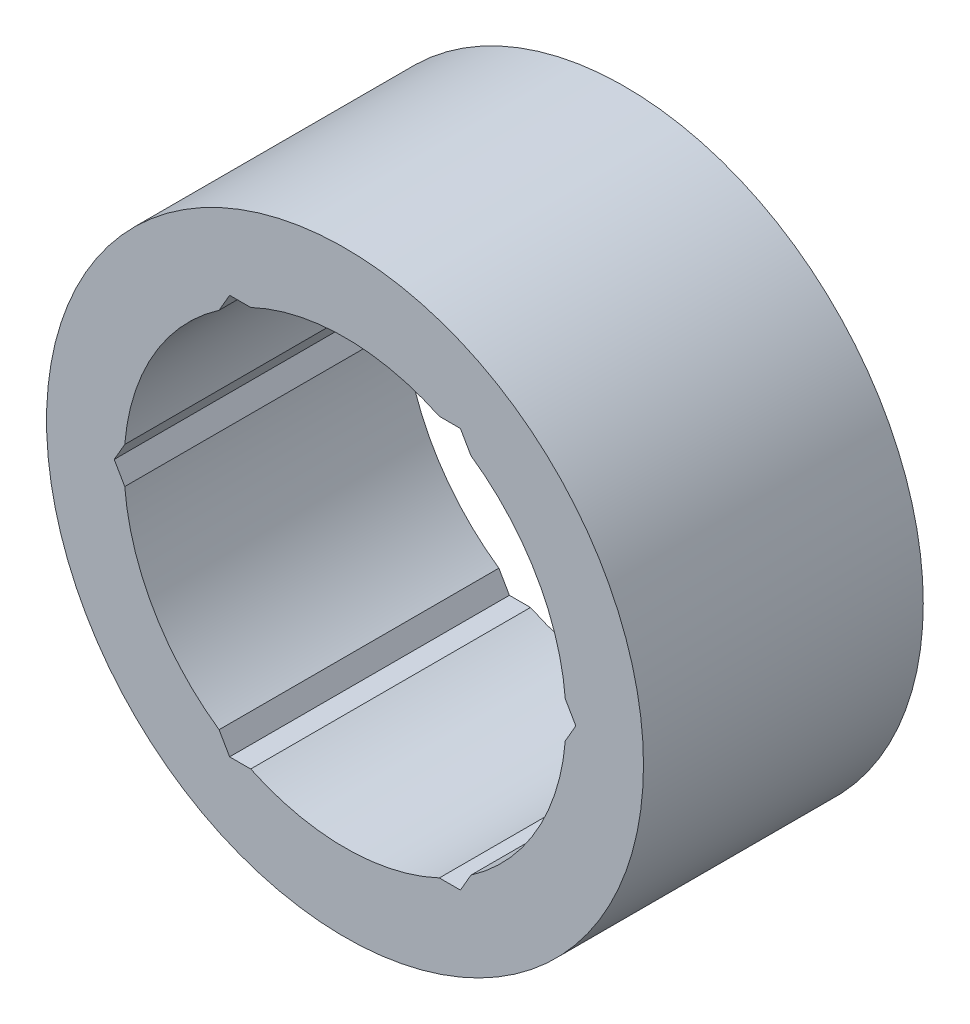
ISO-10303-21;
HEADER;
FILE_DESCRIPTION(('STEP AP214'),'2;1');
FILE_NAME('part.step','',(''),(''),'','','');
FILE_SCHEMA(('AUTOMOTIVE_DESIGN { 1 0 10303 214 1 1 1 1 }'));
ENDSEC;
DATA;
#1=APPLICATION_CONTEXT('core data for automotive mechanical design processes');
#2=APPLICATION_PROTOCOL_DEFINITION('international standard','automotive_design',2000,#1);
#3=PRODUCT_CONTEXT('',#1,'mechanical');
#4=PRODUCT('Part','Part','',(#3));
#5=PRODUCT_RELATED_PRODUCT_CATEGORY('part','',(#4));
#6=PRODUCT_DEFINITION_FORMATION('','',#4);
#7=PRODUCT_DEFINITION_CONTEXT('part definition',#1,'design');
#8=PRODUCT_DEFINITION('design','',#6,#7);
#9=PRODUCT_DEFINITION_SHAPE('','',#8);
#10=(LENGTH_UNIT() NAMED_UNIT(*) SI_UNIT(.MILLI.,.METRE.));
#11=(NAMED_UNIT(*) PLANE_ANGLE_UNIT() SI_UNIT($,.RADIAN.));
#12=(NAMED_UNIT(*) SI_UNIT($,.STERADIAN.) SOLID_ANGLE_UNIT());
#13=UNCERTAINTY_MEASURE_WITH_UNIT(LENGTH_MEASURE(1.E-05),#10,'distance_accuracy_value','');
#14=(GEOMETRIC_REPRESENTATION_CONTEXT(3) GLOBAL_UNCERTAINTY_ASSIGNED_CONTEXT((#13)) GLOBAL_UNIT_ASSIGNED_CONTEXT((#10,
#11,#12)) REPRESENTATION_CONTEXT('',''));
#15=CARTESIAN_POINT('',(0.,0.,0.));
#16=DIRECTION('',(0.,0.,1.));
#17=DIRECTION('',(1.,0.,0.));
#18=AXIS2_PLACEMENT_3D('',#15,#16,#17);
#19=CARTESIAN_POINT('',(0.,0.,5.));
#20=DIRECTION('',(0.,0.,-1.));
#21=DIRECTION('',(-1.,0.,0.));
#22=AXIS2_PLACEMENT_3D('',#19,#20,#21);
#23=CYLINDRICAL_SURFACE('',#22,7.8994);
#24=DIRECTION('',(0.,0.,-1.));
#25=VECTOR('',#24,1.);
#26=CARTESIAN_POINT('',(7.87244448954837,0.652026164336591,5.));
#27=LINE('',#26,#25);
#28=CARTESIAN_POINT('',(7.87244448954837,0.65202616433659,5.));
#29=VERTEX_POINT('',#28);
#30=CARTESIAN_POINT('',(7.87244448954837,0.65202616433659,-5.));
#31=VERTEX_POINT('',#30);
#32=EDGE_CURVE('E12',#29,#31,#27,.T.);
#33=ORIENTED_EDGE('',*,*,#32,.F.);
#34=CARTESIAN_POINT('',(0.,0.,5.));
#35=DIRECTION('',(0.,0.,1.));
#36=DIRECTION('',(1.,0.,0.));
#37=AXIS2_PLACEMENT_3D('',#34,#35,#36);
#38=CIRCLE('',#37,7.8994);
#39=CARTESIAN_POINT('',(4.5008934670218,6.49172383566341,5.));
#40=VERTEX_POINT('',#39);
#41=EDGE_CURVE('E240',#29,#40,#38,.T.);
#42=ORIENTED_EDGE('',*,*,#41,.T.);
#43=DIRECTION('',(0.,0.,-1.));
#44=VECTOR('',#43,1.);
#45=CARTESIAN_POINT('',(4.5008934670218,6.49172383566341,5.));
#46=LINE('',#45,#44);
#47=CARTESIAN_POINT('',(4.5008934670218,6.49172383566341,-5.));
#48=VERTEX_POINT('',#47);
#49=EDGE_CURVE('E49',#48,#40,#46,.F.);
#50=ORIENTED_EDGE('',*,*,#49,.F.);
#51=CARTESIAN_POINT('',(0.,0.,-5.));
#52=DIRECTION('',(0.,0.,1.));
#53=DIRECTION('',(1.,0.,0.));
#54=AXIS2_PLACEMENT_3D('',#51,#52,#53);
#55=CIRCLE('',#54,7.8994);
#56=EDGE_CURVE('E192',#31,#48,#55,.T.);
#57=ORIENTED_EDGE('',*,*,#56,.F.);
#58=EDGE_LOOP('',(#33,#42,#50,#57));
#59=FACE_BOUND('',#58,.T.);
#60=ADVANCED_FACE('F41',(#59),#23,.F.);
#61=DIRECTION('',(0.,0.,-1.));
#62=VECTOR('',#61,1.);
#63=CARTESIAN_POINT('',(4.50089346702179,-6.49172383566342,5.));
#64=LINE('',#63,#62);
#65=CARTESIAN_POINT('',(4.5008934670218,-6.49172383566341,5.));
#66=VERTEX_POINT('',#65);
#67=CARTESIAN_POINT('',(4.5008934670218,-6.49172383566341,-5.));
#68=VERTEX_POINT('',#67);
#69=EDGE_CURVE('E270',#66,#68,#64,.T.);
#70=ORIENTED_EDGE('',*,*,#69,.F.);
#71=CARTESIAN_POINT('',(7.87244448954837,-0.652026164336583,5.));
#72=VERTEX_POINT('',#71);
#73=EDGE_CURVE('E245',#66,#72,#38,.T.);
#74=ORIENTED_EDGE('',*,*,#73,.T.);
#75=DIRECTION('',(0.,0.,-1.));
#76=VECTOR('',#75,1.);
#77=CARTESIAN_POINT('',(7.87244448954837,-0.652026164336583,5.));
#78=LINE('',#77,#76);
#79=CARTESIAN_POINT('',(7.87244448954837,-0.652026164336583,-5.));
#80=VERTEX_POINT('',#79);
#81=EDGE_CURVE('E268',#80,#72,#78,.F.);
#82=ORIENTED_EDGE('',*,*,#81,.F.);
#83=EDGE_CURVE('E228',#68,#80,#55,.T.);
#84=ORIENTED_EDGE('',*,*,#83,.F.);
#85=EDGE_LOOP('',(#70,#74,#82,#84));
#86=FACE_BOUND('',#85,.T.);
#87=ADVANCED_FACE('F352',(#86),#23,.F.);
#88=DIRECTION('',(0.,0.,-1.));
#89=VECTOR('',#88,1.);
#90=CARTESIAN_POINT('',(-3.37155102252657,-7.14375,5.));
#91=LINE('',#90,#89);
#92=CARTESIAN_POINT('',(-3.37155102252657,-7.14375,5.));
#93=VERTEX_POINT('',#92);
#94=CARTESIAN_POINT('',(-3.37155102252657,-7.14375,-5.));
#95=VERTEX_POINT('',#94);
#96=EDGE_CURVE('E266',#93,#95,#91,.T.);
#97=ORIENTED_EDGE('',*,*,#96,.F.);
#98=CARTESIAN_POINT('',(3.37155102252658,-7.14375,5.));
#99=VERTEX_POINT('',#98);
#100=EDGE_CURVE('E338',#93,#99,#38,.T.);
#101=ORIENTED_EDGE('',*,*,#100,.T.);
#102=DIRECTION('',(0.,0.,-1.));
#103=VECTOR('',#102,1.);
#104=CARTESIAN_POINT('',(3.37155102252658,-7.14375,5.));
#105=LINE('',#104,#103);
#106=CARTESIAN_POINT('',(3.37155102252658,-7.14375,-5.));
#107=VERTEX_POINT('',#106);
#108=EDGE_CURVE('E264',#107,#99,#105,.F.);
#109=ORIENTED_EDGE('',*,*,#108,.F.);
#110=EDGE_CURVE('E287',#95,#107,#55,.T.);
#111=ORIENTED_EDGE('',*,*,#110,.F.);
#112=EDGE_LOOP('',(#97,#101,#109,#111));
#113=FACE_BOUND('',#112,.T.);
#114=ADVANCED_FACE('F344',(#113),#23,.F.);
#115=DIRECTION('',(0.,0.,-1.));
#116=VECTOR('',#115,1.);
#117=CARTESIAN_POINT('',(-7.87244448954837,-0.65202616433658,5.));
#118=LINE('',#117,#116);
#119=CARTESIAN_POINT('',(-7.87244448954837,-0.652026164336582,5.));
#120=VERTEX_POINT('',#119);
#121=CARTESIAN_POINT('',(-7.87244448954837,-0.652026164336582,-5.));
#122=VERTEX_POINT('',#121);
#123=EDGE_CURVE('E262',#120,#122,#118,.T.);
#124=ORIENTED_EDGE('',*,*,#123,.F.);
#125=CARTESIAN_POINT('',(-4.50089346702179,-6.49172383566342,5.));
#126=VERTEX_POINT('',#125);
#127=EDGE_CURVE('E324',#120,#126,#38,.T.);
#128=ORIENTED_EDGE('',*,*,#127,.T.);
#129=DIRECTION('',(0.,0.,-1.));
#130=VECTOR('',#129,1.);
#131=CARTESIAN_POINT('',(-4.50089346702179,-6.49172383566342,5.));
#132=LINE('',#131,#130);
#133=CARTESIAN_POINT('',(-4.50089346702179,-6.49172383566342,-5.));
#134=VERTEX_POINT('',#133);
#135=EDGE_CURVE('E260',#134,#126,#132,.F.);
#136=ORIENTED_EDGE('',*,*,#135,.F.);
#137=EDGE_CURVE('E289',#122,#134,#55,.T.);
#138=ORIENTED_EDGE('',*,*,#137,.F.);
#139=EDGE_LOOP('',(#124,#128,#136,#138));
#140=FACE_BOUND('',#139,.T.);
#141=ADVANCED_FACE('F330',(#140),#23,.F.);
#142=DIRECTION('',(0.,0.,-1.));
#143=VECTOR('',#142,1.);
#144=CARTESIAN_POINT('',(-4.50089346702179,6.49172383566342,5.));
#145=LINE('',#144,#143);
#146=CARTESIAN_POINT('',(-4.50089346702179,6.49172383566342,5.));
#147=VERTEX_POINT('',#146);
#148=CARTESIAN_POINT('',(-4.50089346702179,6.49172383566342,-5.));
#149=VERTEX_POINT('',#148);
#150=EDGE_CURVE('E258',#147,#149,#145,.T.);
#151=ORIENTED_EDGE('',*,*,#150,.F.);
#152=CARTESIAN_POINT('',(-7.87244448954837,0.652026164336582,5.));
#153=VERTEX_POINT('',#152);
#154=EDGE_CURVE('E310',#147,#153,#38,.T.);
#155=ORIENTED_EDGE('',*,*,#154,.T.);
#156=DIRECTION('',(0.,0.,-1.));
#157=VECTOR('',#156,1.);
#158=CARTESIAN_POINT('',(-7.87244448954837,0.65202616433658,5.));
#159=LINE('',#158,#157);
#160=CARTESIAN_POINT('',(-7.87244448954837,0.652026164336582,-5.));
#161=VERTEX_POINT('',#160);
#162=EDGE_CURVE('E256',#161,#153,#159,.F.);
#163=ORIENTED_EDGE('',*,*,#162,.F.);
#164=EDGE_CURVE('E292',#149,#161,#55,.T.);
#165=ORIENTED_EDGE('',*,*,#164,.F.);
#166=EDGE_LOOP('',(#151,#155,#163,#165));
#167=FACE_BOUND('',#166,.T.);
#168=ADVANCED_FACE('F316',(#167),#23,.F.);
#169=CARTESIAN_POINT('',(0.,0.,5.));
#170=DIRECTION('',(0.,0.,1.));
#171=DIRECTION('',(1.,0.,0.));
#172=AXIS2_PLACEMENT_3D('',#169,#170,#171);
#173=PLANE('',#172);
#174=DIRECTION('',(-0.5,0.866025403784439,0.));
#175=VECTOR('',#174,1.);
#176=CARTESIAN_POINT('',(8.24889197104678,0.,5.));
#177=LINE('',#176,#175);
#178=CARTESIAN_POINT('',(8.24889197104678,0.,5.));
#179=VERTEX_POINT('',#178);
#180=EDGE_CURVE('E211',#179,#29,#177,.T.);
#181=ORIENTED_EDGE('',*,*,#180,.F.);
#182=DIRECTION('',(0.5,0.866025403784439,0.));
#183=VECTOR('',#182,1.);
#184=CARTESIAN_POINT('',(4.12444598552339,-7.14375,5.));
#185=LINE('',#184,#183);
#186=EDGE_CURVE('E196',#72,#179,#185,.T.);
#187=ORIENTED_EDGE('',*,*,#186,.F.);
#188=ORIENTED_EDGE('',*,*,#73,.F.);
#189=CARTESIAN_POINT('',(4.12444598552339,-7.14375,5.));
#190=VERTEX_POINT('',#189);
#191=EDGE_CURVE('E194',#190,#66,#185,.T.);
#192=ORIENTED_EDGE('',*,*,#191,.F.);
#193=DIRECTION('',(1.,0.,0.));
#194=VECTOR('',#193,1.);
#195=CARTESIAN_POINT('',(-4.12444598552339,-7.14375,5.));
#196=LINE('',#195,#194);
#197=EDGE_CURVE('E222',#99,#190,#196,.T.);
#198=ORIENTED_EDGE('',*,*,#197,.F.);
#199=ORIENTED_EDGE('',*,*,#100,.F.);
#200=CARTESIAN_POINT('',(-4.12444598552339,-7.14375,5.));
#201=VERTEX_POINT('',#200);
#202=EDGE_CURVE('E223',#201,#93,#196,.T.);
#203=ORIENTED_EDGE('',*,*,#202,.F.);
#204=DIRECTION('',(0.5,-0.866025403784439,0.));
#205=VECTOR('',#204,1.);
#206=CARTESIAN_POINT('',(-8.24889197104678,0.,5.));
#207=LINE('',#206,#205);
#208=EDGE_CURVE('E219',#126,#201,#207,.T.);
#209=ORIENTED_EDGE('',*,*,#208,.F.);
#210=ORIENTED_EDGE('',*,*,#127,.F.);
#211=CARTESIAN_POINT('',(-8.24889197104678,0.,5.));
#212=VERTEX_POINT('',#211);
#213=EDGE_CURVE('E220',#212,#120,#207,.T.);
#214=ORIENTED_EDGE('',*,*,#213,.F.);
#215=DIRECTION('',(-0.5,-0.866025403784439,0.));
#216=VECTOR('',#215,1.);
#217=CARTESIAN_POINT('',(-4.12444598552339,7.14375,5.));
#218=LINE('',#217,#216);
#219=EDGE_CURVE('E216',#153,#212,#218,.T.);
#220=ORIENTED_EDGE('',*,*,#219,.F.);
#221=ORIENTED_EDGE('',*,*,#154,.F.);
#222=CARTESIAN_POINT('',(-4.12444598552339,7.14375,5.));
#223=VERTEX_POINT('',#222);
#224=EDGE_CURVE('E217',#223,#147,#218,.T.);
#225=ORIENTED_EDGE('',*,*,#224,.F.);
#226=DIRECTION('',(-1.,0.,0.));
#227=VECTOR('',#226,1.);
#228=CARTESIAN_POINT('',(4.12444598552339,7.14375,5.));
#229=LINE('',#228,#227);
#230=CARTESIAN_POINT('',(-3.37155102252658,7.14375,5.));
#231=VERTEX_POINT('',#230);
#232=EDGE_CURVE('E213',#231,#223,#229,.T.);
#233=ORIENTED_EDGE('',*,*,#232,.F.);
#234=CARTESIAN_POINT('',(3.37155102252658,7.14375,5.));
#235=VERTEX_POINT('',#234);
#236=EDGE_CURVE('E244',#235,#231,#38,.T.);
#237=ORIENTED_EDGE('',*,*,#236,.F.);
#238=CARTESIAN_POINT('',(4.12444598552339,7.14375,5.));
#239=VERTEX_POINT('',#238);
#240=EDGE_CURVE('E214',#239,#235,#229,.T.);
#241=ORIENTED_EDGE('',*,*,#240,.F.);
#242=EDGE_CURVE('E171',#40,#239,#177,.T.);
#243=ORIENTED_EDGE('',*,*,#242,.F.);
#244=ORIENTED_EDGE('',*,*,#41,.F.);
#245=EDGE_LOOP('',(#181,#187,#188,#192,#198,#199,#203,#209,#210,#214,#220,#221,#225,#233,#237,
#241,#243,#244));
#246=FACE_BOUND('',#245,.T.);
#247=CARTESIAN_POINT('',(0.,0.,5.));
#248=DIRECTION('',(0.,0.,1.));
#249=DIRECTION('',(1.,0.,0.));
#250=AXIS2_PLACEMENT_3D('',#247,#248,#249);
#251=CIRCLE('',#250,10.668);
#252=CARTESIAN_POINT('',(10.668,0.,5.));
#253=VERTEX_POINT('',#252);
#254=EDGE_CURVE('E248',#253,#253,#251,.T.);
#255=ORIENTED_EDGE('',*,*,#254,.T.);
#256=EDGE_LOOP('',(#255));
#257=FACE_BOUND('',#256,.T.);
#258=ADVANCED_FACE('F275',(#246,#257),#173,.T.);
#259=CARTESIAN_POINT('',(0.,0.,-5.));
#260=DIRECTION('',(0.,0.,1.));
#261=DIRECTION('',(1.,0.,0.));
#262=AXIS2_PLACEMENT_3D('',#259,#260,#261);
#263=PLANE('',#262);
#264=CARTESIAN_POINT('',(0.,0.,-5.));
#265=DIRECTION('',(0.,0.,1.));
#266=DIRECTION('',(1.,0.,0.));
#267=AXIS2_PLACEMENT_3D('',#264,#265,#266);
#268=CIRCLE('',#267,10.668);
#269=CARTESIAN_POINT('',(10.668,0.,-5.));
#270=VERTEX_POINT('',#269);
#271=EDGE_CURVE('E243',#270,#270,#268,.T.);
#272=ORIENTED_EDGE('',*,*,#271,.F.);
#273=EDGE_LOOP('',(#272));
#274=FACE_BOUND('',#273,.T.);
#275=DIRECTION('',(0.5,0.866025403784439,0.));
#276=VECTOR('',#275,1.);
#277=CARTESIAN_POINT('',(4.12444598552339,-7.14375,-5.));
#278=LINE('',#277,#276);
#279=CARTESIAN_POINT('',(8.24889197104678,0.,-5.));
#280=VERTEX_POINT('',#279);
#281=EDGE_CURVE('E56',#80,#280,#278,.T.);
#282=ORIENTED_EDGE('',*,*,#281,.T.);
#283=DIRECTION('',(-0.5,0.866025403784439,0.));
#284=VECTOR('',#283,1.);
#285=CARTESIAN_POINT('',(8.24889197104678,0.,-5.));
#286=LINE('',#285,#284);
#287=EDGE_CURVE('E193',#280,#31,#286,.T.);
#288=ORIENTED_EDGE('',*,*,#287,.T.);
#289=ORIENTED_EDGE('',*,*,#56,.T.);
#290=CARTESIAN_POINT('',(4.12444598552339,7.14375,-5.));
#291=VERTEX_POINT('',#290);
#292=EDGE_CURVE('E168',#48,#291,#286,.T.);
#293=ORIENTED_EDGE('',*,*,#292,.T.);
#294=DIRECTION('',(-1.,0.,0.));
#295=VECTOR('',#294,1.);
#296=CARTESIAN_POINT('',(4.12444598552339,7.14375,-5.));
#297=LINE('',#296,#295);
#298=CARTESIAN_POINT('',(3.37155102252658,7.14375,-5.));
#299=VERTEX_POINT('',#298);
#300=EDGE_CURVE('E178',#291,#299,#297,.T.);
#301=ORIENTED_EDGE('',*,*,#300,.T.);
#302=CARTESIAN_POINT('',(-3.37155102252658,7.14375,-5.));
#303=VERTEX_POINT('',#302);
#304=EDGE_CURVE('E247',#299,#303,#55,.T.);
#305=ORIENTED_EDGE('',*,*,#304,.T.);
#306=CARTESIAN_POINT('',(-4.12444598552339,7.14375,-5.));
#307=VERTEX_POINT('',#306);
#308=EDGE_CURVE('E186',#303,#307,#297,.T.);
#309=ORIENTED_EDGE('',*,*,#308,.T.);
#310=DIRECTION('',(-0.5,-0.866025403784439,0.));
#311=VECTOR('',#310,1.);
#312=CARTESIAN_POINT('',(-4.12444598552339,7.14375,-5.));
#313=LINE('',#312,#311);
#314=EDGE_CURVE('E199',#307,#149,#313,.T.);
#315=ORIENTED_EDGE('',*,*,#314,.T.);
#316=ORIENTED_EDGE('',*,*,#164,.T.);
#317=CARTESIAN_POINT('',(-8.24889197104678,0.,-5.));
#318=VERTEX_POINT('',#317);
#319=EDGE_CURVE('E185',#161,#318,#313,.T.);
#320=ORIENTED_EDGE('',*,*,#319,.T.);
#321=DIRECTION('',(0.5,-0.866025403784439,0.));
#322=VECTOR('',#321,1.);
#323=CARTESIAN_POINT('',(-8.24889197104678,0.,-5.));
#324=LINE('',#323,#322);
#325=EDGE_CURVE('E203',#318,#122,#324,.T.);
#326=ORIENTED_EDGE('',*,*,#325,.T.);
#327=ORIENTED_EDGE('',*,*,#137,.T.);
#328=CARTESIAN_POINT('',(-4.12444598552339,-7.14375,-5.));
#329=VERTEX_POINT('',#328);
#330=EDGE_CURVE('E202',#134,#329,#324,.T.);
#331=ORIENTED_EDGE('',*,*,#330,.T.);
#332=DIRECTION('',(1.,0.,0.));
#333=VECTOR('',#332,1.);
#334=CARTESIAN_POINT('',(-4.12444598552339,-7.14375,-5.));
#335=LINE('',#334,#333);
#336=EDGE_CURVE('E206',#329,#95,#335,.T.);
#337=ORIENTED_EDGE('',*,*,#336,.T.);
#338=ORIENTED_EDGE('',*,*,#110,.T.);
#339=CARTESIAN_POINT('',(4.12444598552339,-7.14375,-5.));
#340=VERTEX_POINT('',#339);
#341=EDGE_CURVE('E64',#107,#340,#335,.T.);
#342=ORIENTED_EDGE('',*,*,#341,.T.);
#343=EDGE_CURVE('E175',#340,#68,#278,.T.);
#344=ORIENTED_EDGE('',*,*,#343,.T.);
#345=ORIENTED_EDGE('',*,*,#83,.T.);
#346=EDGE_LOOP('',(#282,#288,#289,#293,#301,#305,#309,#315,#316,#320,#326,#327,#331,#337,#338,
#342,#344,#345));
#347=FACE_BOUND('',#346,.T.);
#348=ADVANCED_FACE('F189',(#274,#347),#263,.F.);
#349=CARTESIAN_POINT('',(0.,0.,5.));
#350=DIRECTION('',(0.,0.,-1.));
#351=DIRECTION('',(-1.,0.,0.));
#352=AXIS2_PLACEMENT_3D('',#349,#350,#351);
#353=CYLINDRICAL_SURFACE('',#352,10.668);
#354=ORIENTED_EDGE('',*,*,#254,.F.);
#355=EDGE_LOOP('',(#354));
#356=FACE_BOUND('',#355,.T.);
#357=ORIENTED_EDGE('',*,*,#271,.T.);
#358=EDGE_LOOP('',(#357));
#359=FACE_BOUND('',#358,.T.);
#360=ADVANCED_FACE('F43',(#356,#359),#353,.T.);
#361=DIRECTION('',(0.,0.,-1.));
#362=VECTOR('',#361,1.);
#363=CARTESIAN_POINT('',(3.37155102252658,7.14375,5.));
#364=LINE('',#363,#362);
#365=EDGE_CURVE('E181',#235,#299,#364,.T.);
#366=ORIENTED_EDGE('',*,*,#365,.F.);
#367=ORIENTED_EDGE('',*,*,#236,.T.);
#368=DIRECTION('',(0.,0.,-1.));
#369=VECTOR('',#368,1.);
#370=CARTESIAN_POINT('',(-3.37155102252658,7.14375,5.));
#371=LINE('',#370,#369);
#372=EDGE_CURVE('E251',#303,#231,#371,.F.);
#373=ORIENTED_EDGE('',*,*,#372,.F.);
#374=ORIENTED_EDGE('',*,*,#304,.F.);
#375=EDGE_LOOP('',(#366,#367,#373,#374));
#376=FACE_BOUND('',#375,.T.);
#377=ADVANCED_FACE('F301',(#376),#23,.F.);
#378=CARTESIAN_POINT('',(4.12444598552339,7.14375,-5.));
#379=DIRECTION('',(0.,1.,0.));
#380=DIRECTION('',(-1.,0.,0.));
#381=AXIS2_PLACEMENT_3D('',#378,#379,#380);
#382=PLANE('',#381);
#383=ORIENTED_EDGE('',*,*,#372,.T.);
#384=ORIENTED_EDGE('',*,*,#232,.T.);
#385=DIRECTION('',(0.,0.,1.));
#386=VECTOR('',#385,1.);
#387=CARTESIAN_POINT('',(-4.12444598552339,7.14375,-5.));
#388=LINE('',#387,#386);
#389=EDGE_CURVE('E174',#307,#223,#388,.T.);
#390=ORIENTED_EDGE('',*,*,#389,.F.);
#391=ORIENTED_EDGE('',*,*,#308,.F.);
#392=EDGE_LOOP('',(#383,#384,#390,#391));
#393=FACE_BOUND('',#392,.T.);
#394=ADVANCED_FACE('F305',(#393),#382,.F.);
#395=CARTESIAN_POINT('',(-4.12444598552339,7.14375,-5.));
#396=DIRECTION('',(-0.866025403784439,0.5,0.));
#397=DIRECTION('',(-0.5,-0.866025403784439,0.));
#398=AXIS2_PLACEMENT_3D('',#395,#396,#397);
#399=PLANE('',#398);
#400=ORIENTED_EDGE('',*,*,#150,.T.);
#401=ORIENTED_EDGE('',*,*,#314,.F.);
#402=ORIENTED_EDGE('',*,*,#389,.T.);
#403=ORIENTED_EDGE('',*,*,#224,.T.);
#404=EDGE_LOOP('',(#400,#401,#402,#403));
#405=FACE_BOUND('',#404,.T.);
#406=ADVANCED_FACE('F313',(#405),#399,.F.);
#407=ORIENTED_EDGE('',*,*,#365,.T.);
#408=ORIENTED_EDGE('',*,*,#300,.F.);
#409=DIRECTION('',(0.,0.,1.));
#410=VECTOR('',#409,1.);
#411=CARTESIAN_POINT('',(4.12444598552339,7.14375,-5.));
#412=LINE('',#411,#410);
#413=EDGE_CURVE('E164',#291,#239,#412,.T.);
#414=ORIENTED_EDGE('',*,*,#413,.T.);
#415=ORIENTED_EDGE('',*,*,#240,.T.);
#416=EDGE_LOOP('',(#407,#408,#414,#415));
#417=FACE_BOUND('',#416,.T.);
#418=ADVANCED_FACE('F179',(#417),#382,.F.);
#419=CARTESIAN_POINT('',(8.24889197104678,0.,-5.));
#420=DIRECTION('',(0.866025403784439,0.5,0.));
#421=DIRECTION('',(-0.5,0.866025403784439,0.));
#422=AXIS2_PLACEMENT_3D('',#419,#420,#421);
#423=PLANE('',#422);
#424=ORIENTED_EDGE('',*,*,#49,.T.);
#425=ORIENTED_EDGE('',*,*,#242,.T.);
#426=ORIENTED_EDGE('',*,*,#413,.F.);
#427=ORIENTED_EDGE('',*,*,#292,.F.);
#428=EDGE_LOOP('',(#424,#425,#426,#427));
#429=FACE_BOUND('',#428,.T.);
#430=ADVANCED_FACE('F166',(#429),#423,.F.);
#431=ORIENTED_EDGE('',*,*,#162,.T.);
#432=ORIENTED_EDGE('',*,*,#219,.T.);
#433=DIRECTION('',(0.,0.,1.));
#434=VECTOR('',#433,1.);
#435=CARTESIAN_POINT('',(-8.24889197104678,0.,-5.));
#436=LINE('',#435,#434);
#437=EDGE_CURVE('E235',#318,#212,#436,.T.);
#438=ORIENTED_EDGE('',*,*,#437,.F.);
#439=ORIENTED_EDGE('',*,*,#319,.F.);
#440=EDGE_LOOP('',(#431,#432,#438,#439));
#441=FACE_BOUND('',#440,.T.);
#442=ADVANCED_FACE('F319',(#441),#399,.F.);
#443=CARTESIAN_POINT('',(-8.24889197104678,0.,-5.));
#444=DIRECTION('',(-0.866025403784439,-0.5,0.));
#445=DIRECTION('',(0.5,-0.866025403784439,0.));
#446=AXIS2_PLACEMENT_3D('',#443,#444,#445);
#447=PLANE('',#446);
#448=ORIENTED_EDGE('',*,*,#123,.T.);
#449=ORIENTED_EDGE('',*,*,#325,.F.);
#450=ORIENTED_EDGE('',*,*,#437,.T.);
#451=ORIENTED_EDGE('',*,*,#213,.T.);
#452=EDGE_LOOP('',(#448,#449,#450,#451));
#453=FACE_BOUND('',#452,.T.);
#454=ADVANCED_FACE('F327',(#453),#447,.F.);
#455=ORIENTED_EDGE('',*,*,#135,.T.);
#456=ORIENTED_EDGE('',*,*,#208,.T.);
#457=DIRECTION('',(0.,0.,1.));
#458=VECTOR('',#457,1.);
#459=CARTESIAN_POINT('',(-4.12444598552339,-7.14375,-5.));
#460=LINE('',#459,#458);
#461=EDGE_CURVE('E232',#329,#201,#460,.T.);
#462=ORIENTED_EDGE('',*,*,#461,.F.);
#463=ORIENTED_EDGE('',*,*,#330,.F.);
#464=EDGE_LOOP('',(#455,#456,#462,#463));
#465=FACE_BOUND('',#464,.T.);
#466=ADVANCED_FACE('F333',(#465),#447,.F.);
#467=CARTESIAN_POINT('',(-4.12444598552339,-7.14375,-5.));
#468=DIRECTION('',(0.,-1.,0.));
#469=DIRECTION('',(1.,0.,0.));
#470=AXIS2_PLACEMENT_3D('',#467,#468,#469);
#471=PLANE('',#470);
#472=ORIENTED_EDGE('',*,*,#96,.T.);
#473=ORIENTED_EDGE('',*,*,#336,.F.);
#474=ORIENTED_EDGE('',*,*,#461,.T.);
#475=ORIENTED_EDGE('',*,*,#202,.T.);
#476=EDGE_LOOP('',(#472,#473,#474,#475));
#477=FACE_BOUND('',#476,.T.);
#478=ADVANCED_FACE('F341',(#477),#471,.F.);
#479=ORIENTED_EDGE('',*,*,#108,.T.);
#480=ORIENTED_EDGE('',*,*,#197,.T.);
#481=DIRECTION('',(0.,0.,1.));
#482=VECTOR('',#481,1.);
#483=CARTESIAN_POINT('',(4.12444598552339,-7.14375,-5.));
#484=LINE('',#483,#482);
#485=EDGE_CURVE('E229',#340,#190,#484,.T.);
#486=ORIENTED_EDGE('',*,*,#485,.F.);
#487=ORIENTED_EDGE('',*,*,#341,.F.);
#488=EDGE_LOOP('',(#479,#480,#486,#487));
#489=FACE_BOUND('',#488,.T.);
#490=ADVANCED_FACE('F345',(#489),#471,.F.);
#491=CARTESIAN_POINT('',(4.12444598552339,-7.14375,-5.));
#492=DIRECTION('',(0.866025403784439,-0.5,0.));
#493=DIRECTION('',(0.5,0.866025403784439,0.));
#494=AXIS2_PLACEMENT_3D('',#491,#492,#493);
#495=PLANE('',#494);
#496=ORIENTED_EDGE('',*,*,#69,.T.);
#497=ORIENTED_EDGE('',*,*,#343,.F.);
#498=ORIENTED_EDGE('',*,*,#485,.T.);
#499=ORIENTED_EDGE('',*,*,#191,.T.);
#500=EDGE_LOOP('',(#496,#497,#498,#499));
#501=FACE_BOUND('',#500,.T.);
#502=ADVANCED_FACE('F351',(#501),#495,.F.);
#503=ORIENTED_EDGE('',*,*,#32,.T.);
#504=ORIENTED_EDGE('',*,*,#287,.F.);
#505=DIRECTION('',(0.,0.,1.));
#506=VECTOR('',#505,1.);
#507=CARTESIAN_POINT('',(8.24889197104678,0.,-5.));
#508=LINE('',#507,#506);
#509=EDGE_CURVE('E225',#280,#179,#508,.T.);
#510=ORIENTED_EDGE('',*,*,#509,.T.);
#511=ORIENTED_EDGE('',*,*,#180,.T.);
#512=EDGE_LOOP('',(#503,#504,#510,#511));
#513=FACE_BOUND('',#512,.T.);
#514=ADVANCED_FACE('F281',(#513),#423,.F.);
#515=ORIENTED_EDGE('',*,*,#81,.T.);
#516=ORIENTED_EDGE('',*,*,#186,.T.);
#517=ORIENTED_EDGE('',*,*,#509,.F.);
#518=ORIENTED_EDGE('',*,*,#281,.F.);
#519=EDGE_LOOP('',(#515,#516,#517,#518));
#520=FACE_BOUND('',#519,.T.);
#521=ADVANCED_FACE('F353',(#520),#495,.F.);
#522=CLOSED_SHELL('',(#60,#87,#114,#141,#168,#258,#348,#360,#377,#394,#406,#418,#430,#442,#454,
#466,#478,#490,#502,#514,#521));
#523=MANIFOLD_SOLID_BREP('B2',#522);
#524=ADVANCED_BREP_SHAPE_REPRESENTATION('',(#18,#523),#14);
#525=SHAPE_DEFINITION_REPRESENTATION(#9,#524);
ENDSEC;
END-ISO-10303-21;
